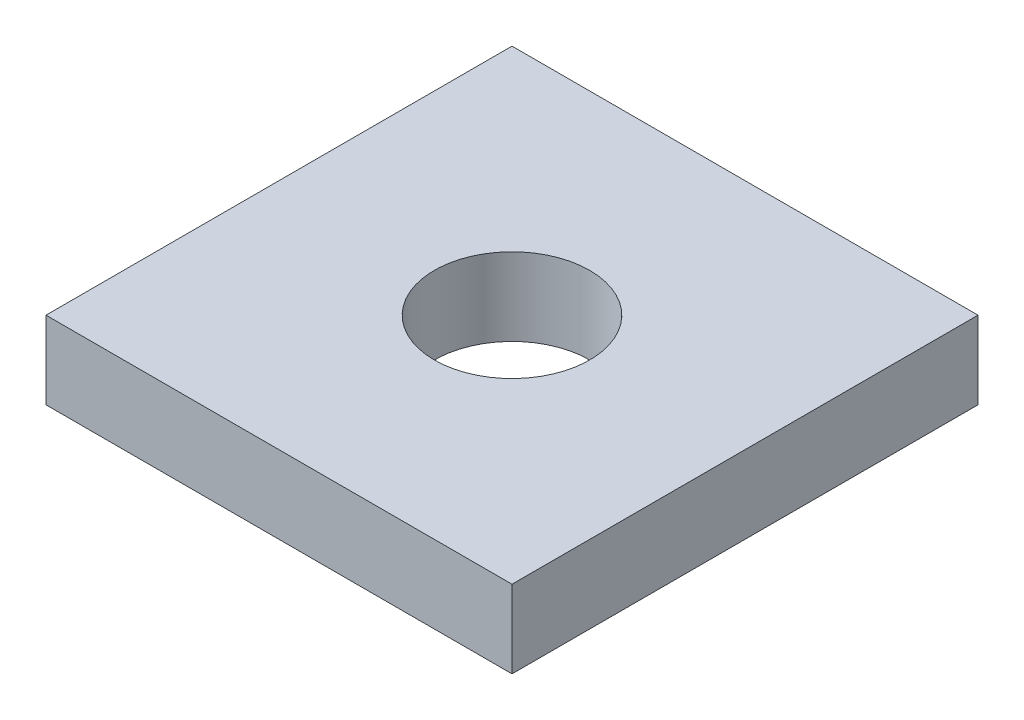
ISO-10303-21;
HEADER;
FILE_DESCRIPTION(('STEP AP214'),'2;1');
FILE_NAME('part.step','',(''),(''),'','','');
FILE_SCHEMA(('AUTOMOTIVE_DESIGN { 1 0 10303 214 1 1 1 1 }'));
ENDSEC;
DATA;
#1=APPLICATION_CONTEXT('core data for automotive mechanical design processes');
#2=APPLICATION_PROTOCOL_DEFINITION('international standard','automotive_design',2000,#1);
#3=PRODUCT_CONTEXT('',#1,'mechanical');
#4=PRODUCT('Part','Part','',(#3));
#5=PRODUCT_RELATED_PRODUCT_CATEGORY('part','',(#4));
#6=PRODUCT_DEFINITION_FORMATION('','',#4);
#7=PRODUCT_DEFINITION_CONTEXT('part definition',#1,'design');
#8=PRODUCT_DEFINITION('design','',#6,#7);
#9=PRODUCT_DEFINITION_SHAPE('','',#8);
#10=(LENGTH_UNIT() NAMED_UNIT(*) SI_UNIT(.MILLI.,.METRE.));
#11=(NAMED_UNIT(*) PLANE_ANGLE_UNIT() SI_UNIT($,.RADIAN.));
#12=(NAMED_UNIT(*) SI_UNIT($,.STERADIAN.) SOLID_ANGLE_UNIT());
#13=UNCERTAINTY_MEASURE_WITH_UNIT(LENGTH_MEASURE(1.E-05),#10,'distance_accuracy_value','');
#14=(GEOMETRIC_REPRESENTATION_CONTEXT(3) GLOBAL_UNCERTAINTY_ASSIGNED_CONTEXT((#13)) GLOBAL_UNIT_ASSIGNED_CONTEXT((#10,
#11,#12)) REPRESENTATION_CONTEXT('',''));
#15=CARTESIAN_POINT('',(0.,0.,0.));
#16=DIRECTION('',(0.,0.,1.));
#17=DIRECTION('',(1.,0.,0.));
#18=AXIS2_PLACEMENT_3D('',#15,#16,#17);
#19=CARTESIAN_POINT('',(0.,12.7,0.));
#20=DIRECTION('',(1.,0.,0.));
#21=DIRECTION('',(0.,0.,-1.));
#22=AXIS2_PLACEMENT_3D('',#19,#20,#21);
#23=PLANE('',#22);
#24=DIRECTION('',(0.,0.,1.));
#25=VECTOR('',#24,1.);
#26=CARTESIAN_POINT('',(0.,0.,0.));
#27=LINE('',#26,#25);
#28=CARTESIAN_POINT('',(0.,0.,-76.2));
#29=VERTEX_POINT('',#28);
#30=CARTESIAN_POINT('',(0.,0.,0.));
#31=VERTEX_POINT('',#30);
#32=EDGE_CURVE('E80',#29,#31,#27,.T.);
#33=ORIENTED_EDGE('',*,*,#32,.T.);
#34=DIRECTION('',(0.,-1.,0.));
#35=VECTOR('',#34,1.);
#36=CARTESIAN_POINT('',(0.,12.7,0.));
#37=LINE('',#36,#35);
#38=CARTESIAN_POINT('',(0.,12.7,0.));
#39=VERTEX_POINT('',#38);
#40=EDGE_CURVE('E11',#39,#31,#37,.T.);
#41=ORIENTED_EDGE('',*,*,#40,.F.);
#42=DIRECTION('',(0.,0.,1.));
#43=VECTOR('',#42,1.);
#44=CARTESIAN_POINT('',(0.,12.7,0.));
#45=LINE('',#44,#43);
#46=CARTESIAN_POINT('',(0.,12.7,-76.2));
#47=VERTEX_POINT('',#46);
#48=EDGE_CURVE('E68',#47,#39,#45,.T.);
#49=ORIENTED_EDGE('',*,*,#48,.F.);
#50=DIRECTION('',(0.,-1.,0.));
#51=VECTOR('',#50,1.);
#52=CARTESIAN_POINT('',(0.,12.7,-76.2));
#53=LINE('',#52,#51);
#54=EDGE_CURVE('E76',#47,#29,#53,.T.);
#55=ORIENTED_EDGE('',*,*,#54,.T.);
#56=EDGE_LOOP('',(#33,#41,#49,#55));
#57=FACE_BOUND('',#56,.T.);
#58=ADVANCED_FACE('F17',(#57),#23,.F.);
#59=CARTESIAN_POINT('',(0.,12.7,0.));
#60=DIRECTION('',(0.,0.,-1.));
#61=DIRECTION('',(-1.,0.,0.));
#62=AXIS2_PLACEMENT_3D('',#59,#60,#61);
#63=PLANE('',#62);
#64=DIRECTION('',(1.,0.,0.));
#65=VECTOR('',#64,1.);
#66=CARTESIAN_POINT('',(0.,0.,0.));
#67=LINE('',#66,#65);
#68=CARTESIAN_POINT('',(76.2,0.,0.));
#69=VERTEX_POINT('',#68);
#70=EDGE_CURVE('E72',#31,#69,#67,.T.);
#71=ORIENTED_EDGE('',*,*,#70,.T.);
#72=DIRECTION('',(0.,-1.,0.));
#73=VECTOR('',#72,1.);
#74=CARTESIAN_POINT('',(76.2,12.7,0.));
#75=LINE('',#74,#73);
#76=CARTESIAN_POINT('',(76.2,12.7,0.));
#77=VERTEX_POINT('',#76);
#78=EDGE_CURVE('E25',#77,#69,#75,.T.);
#79=ORIENTED_EDGE('',*,*,#78,.F.);
#80=DIRECTION('',(1.,0.,0.));
#81=VECTOR('',#80,1.);
#82=CARTESIAN_POINT('',(0.,12.7,0.));
#83=LINE('',#82,#81);
#84=EDGE_CURVE('E63',#39,#77,#83,.T.);
#85=ORIENTED_EDGE('',*,*,#84,.F.);
#86=ORIENTED_EDGE('',*,*,#40,.T.);
#87=EDGE_LOOP('',(#71,#79,#85,#86));
#88=FACE_BOUND('',#87,.T.);
#89=ADVANCED_FACE('F71',(#88),#63,.F.);
#90=CARTESIAN_POINT('',(76.2,12.7,0.));
#91=DIRECTION('',(-1.,0.,0.));
#92=DIRECTION('',(0.,0.,1.));
#93=AXIS2_PLACEMENT_3D('',#90,#91,#92);
#94=PLANE('',#93);
#95=DIRECTION('',(0.,0.,-1.));
#96=VECTOR('',#95,1.);
#97=CARTESIAN_POINT('',(76.2,0.,0.));
#98=LINE('',#97,#96);
#99=CARTESIAN_POINT('',(76.2,0.,-76.2));
#100=VERTEX_POINT('',#99);
#101=EDGE_CURVE('E50',#69,#100,#98,.T.);
#102=ORIENTED_EDGE('',*,*,#101,.T.);
#103=DIRECTION('',(0.,-1.,0.));
#104=VECTOR('',#103,1.);
#105=CARTESIAN_POINT('',(76.2,12.7,-76.2));
#106=LINE('',#105,#104);
#107=CARTESIAN_POINT('',(76.2,12.7,-76.2));
#108=VERTEX_POINT('',#107);
#109=EDGE_CURVE('E73',#108,#100,#106,.T.);
#110=ORIENTED_EDGE('',*,*,#109,.F.);
#111=DIRECTION('',(0.,0.,-1.));
#112=VECTOR('',#111,1.);
#113=CARTESIAN_POINT('',(76.2,12.7,0.));
#114=LINE('',#113,#112);
#115=EDGE_CURVE('E66',#77,#108,#114,.T.);
#116=ORIENTED_EDGE('',*,*,#115,.F.);
#117=ORIENTED_EDGE('',*,*,#78,.T.);
#118=EDGE_LOOP('',(#102,#110,#116,#117));
#119=FACE_BOUND('',#118,.T.);
#120=ADVANCED_FACE('F74',(#119),#94,.F.);
#121=CARTESIAN_POINT('',(0.,12.7,-76.2));
#122=DIRECTION('',(0.,0.,1.));
#123=DIRECTION('',(1.,0.,0.));
#124=AXIS2_PLACEMENT_3D('',#121,#122,#123);
#125=PLANE('',#124);
#126=DIRECTION('',(-1.,0.,0.));
#127=VECTOR('',#126,1.);
#128=CARTESIAN_POINT('',(0.,0.,-76.2));
#129=LINE('',#128,#127);
#130=EDGE_CURVE('E56',#100,#29,#129,.T.);
#131=ORIENTED_EDGE('',*,*,#130,.T.);
#132=ORIENTED_EDGE('',*,*,#54,.F.);
#133=DIRECTION('',(-1.,0.,0.));
#134=VECTOR('',#133,1.);
#135=CARTESIAN_POINT('',(0.,12.7,-76.2));
#136=LINE('',#135,#134);
#137=EDGE_CURVE('E33',#108,#47,#136,.T.);
#138=ORIENTED_EDGE('',*,*,#137,.F.);
#139=ORIENTED_EDGE('',*,*,#109,.T.);
#140=EDGE_LOOP('',(#131,#132,#138,#139));
#141=FACE_BOUND('',#140,.T.);
#142=ADVANCED_FACE('F88',(#141),#125,.F.);
#143=CARTESIAN_POINT('',(0.,12.7,-76.2));
#144=DIRECTION('',(0.,-1.,0.));
#145=DIRECTION('',(0.,0.,-1.));
#146=AXIS2_PLACEMENT_3D('',#143,#144,#145);
#147=PLANE('',#146);
#148=CARTESIAN_POINT('',(38.1,12.7,-38.1));
#149=DIRECTION('',(0.,1.,0.));
#150=DIRECTION('',(0.,0.,1.));
#151=AXIS2_PLACEMENT_3D('',#148,#149,#150);
#152=CIRCLE('',#151,12.7);
#153=CARTESIAN_POINT('',(38.1,12.7,-25.4));
#154=VERTEX_POINT('',#153);
#155=EDGE_CURVE('E83',#154,#154,#152,.T.);
#156=ORIENTED_EDGE('',*,*,#155,.F.);
#157=EDGE_LOOP('',(#156));
#158=FACE_BOUND('',#157,.T.);
#159=ORIENTED_EDGE('',*,*,#48,.T.);
#160=ORIENTED_EDGE('',*,*,#84,.T.);
#161=ORIENTED_EDGE('',*,*,#115,.T.);
#162=ORIENTED_EDGE('',*,*,#137,.T.);
#163=EDGE_LOOP('',(#159,#160,#161,#162));
#164=FACE_BOUND('',#163,.T.);
#165=ADVANCED_FACE('F64',(#158,#164),#147,.F.);
#166=CARTESIAN_POINT('',(0.,0.,-76.2));
#167=DIRECTION('',(0.,-1.,0.));
#168=DIRECTION('',(0.,0.,-1.));
#169=AXIS2_PLACEMENT_3D('',#166,#167,#168);
#170=PLANE('',#169);
#171=CARTESIAN_POINT('',(38.1,0.,-38.1));
#172=DIRECTION('',(0.,-1.,0.));
#173=DIRECTION('',(0.,0.,-1.));
#174=AXIS2_PLACEMENT_3D('',#171,#172,#173);
#175=CIRCLE('',#174,12.7);
#176=CARTESIAN_POINT('',(38.1,0.,-50.8));
#177=VERTEX_POINT('',#176);
#178=EDGE_CURVE('E94',#177,#177,#175,.F.);
#179=ORIENTED_EDGE('',*,*,#178,.T.);
#180=EDGE_LOOP('',(#179));
#181=FACE_BOUND('',#180,.T.);
#182=ORIENTED_EDGE('',*,*,#32,.F.);
#183=ORIENTED_EDGE('',*,*,#130,.F.);
#184=ORIENTED_EDGE('',*,*,#101,.F.);
#185=ORIENTED_EDGE('',*,*,#70,.F.);
#186=EDGE_LOOP('',(#182,#183,#184,#185));
#187=FACE_BOUND('',#186,.T.);
#188=ADVANCED_FACE('F91',(#181,#187),#170,.T.);
#189=CARTESIAN_POINT('',(38.1,-0.000999999999999265,-38.1));
#190=DIRECTION('',(0.,1.,0.));
#191=DIRECTION('',(0.,0.,1.));
#192=AXIS2_PLACEMENT_3D('',#189,#190,#191);
#193=CYLINDRICAL_SURFACE('',#192,12.7);
#194=ORIENTED_EDGE('',*,*,#178,.F.);
#195=EDGE_LOOP('',(#194));
#196=FACE_BOUND('',#195,.T.);
#197=ORIENTED_EDGE('',*,*,#155,.T.);
#198=EDGE_LOOP('',(#197));
#199=FACE_BOUND('',#198,.T.);
#200=ADVANCED_FACE('F100',(#196,#199),#193,.F.);
#201=CLOSED_SHELL('',(#58,#89,#120,#142,#165,#188,#200));
#202=MANIFOLD_SOLID_BREP('B1',#201);
#203=ADVANCED_BREP_SHAPE_REPRESENTATION('',(#18,#202),#14);
#204=SHAPE_DEFINITION_REPRESENTATION(#9,#203);
ENDSEC;
END-ISO-10303-21;
